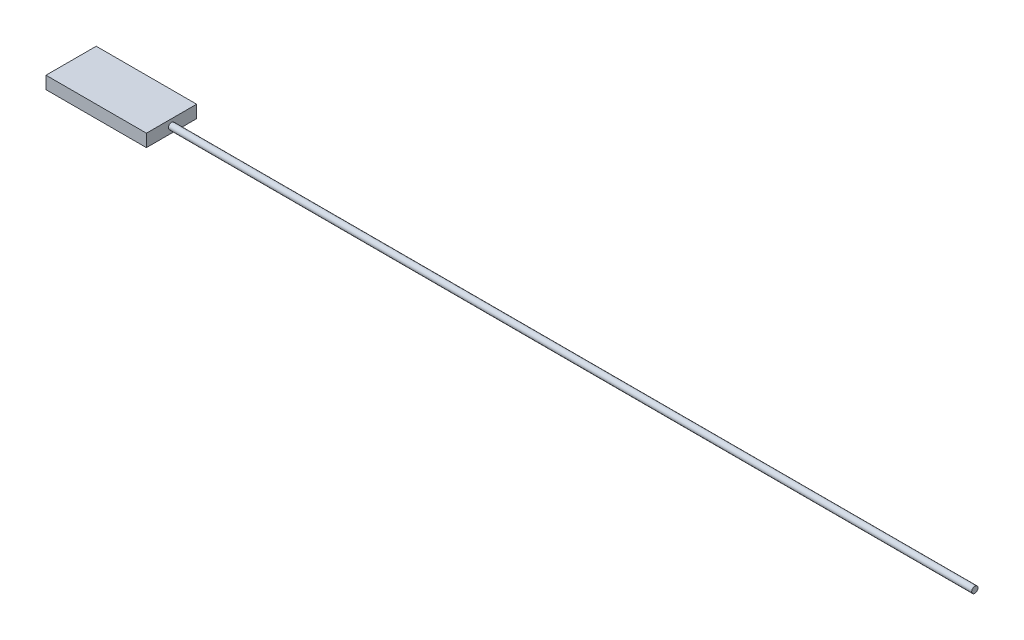
ISO-10303-21;
HEADER;
FILE_DESCRIPTION(('STEP AP214'),'2;1');
FILE_NAME('part.step','',(''),(''),'','','');
FILE_SCHEMA(('AUTOMOTIVE_DESIGN { 1 0 10303 214 1 1 1 1 }'));
ENDSEC;
DATA;
#1=APPLICATION_CONTEXT('core data for automotive mechanical design processes');
#2=APPLICATION_PROTOCOL_DEFINITION('international standard','automotive_design',2000,#1);
#3=PRODUCT_CONTEXT('',#1,'mechanical');
#4=PRODUCT('Part','Part','',(#3));
#5=PRODUCT_RELATED_PRODUCT_CATEGORY('part','',(#4));
#6=PRODUCT_DEFINITION_FORMATION('','',#4);
#7=PRODUCT_DEFINITION_CONTEXT('part definition',#1,'design');
#8=PRODUCT_DEFINITION('design','',#6,#7);
#9=PRODUCT_DEFINITION_SHAPE('','',#8);
#10=(LENGTH_UNIT() NAMED_UNIT(*) SI_UNIT(.MILLI.,.METRE.));
#11=(NAMED_UNIT(*) PLANE_ANGLE_UNIT() SI_UNIT($,.RADIAN.));
#12=(NAMED_UNIT(*) SI_UNIT($,.STERADIAN.) SOLID_ANGLE_UNIT());
#13=UNCERTAINTY_MEASURE_WITH_UNIT(LENGTH_MEASURE(1.E-05),#10,'distance_accuracy_value','');
#14=(GEOMETRIC_REPRESENTATION_CONTEXT(3) GLOBAL_UNCERTAINTY_ASSIGNED_CONTEXT((#13)) GLOBAL_UNIT_ASSIGNED_CONTEXT((#10,
#11,#12)) REPRESENTATION_CONTEXT('',''));
#15=CARTESIAN_POINT('',(0.,0.,0.));
#16=DIRECTION('',(0.,0.,1.));
#17=DIRECTION('',(1.,0.,0.));
#18=AXIS2_PLACEMENT_3D('',#15,#16,#17);
#19=CARTESIAN_POINT('',(25.4,6.35,12.7));
#20=DIRECTION('',(-1.,0.,0.));
#21=DIRECTION('',(0.,0.,1.));
#22=AXIS2_PLACEMENT_3D('',#19,#20,#21);
#23=PLANE('',#22);
#24=CARTESIAN_POINT('',(25.4,3.175,0.));
#25=DIRECTION('',(-1.,0.,0.));
#26=DIRECTION('',(0.,0.,1.));
#27=AXIS2_PLACEMENT_3D('',#24,#25,#26);
#28=CIRCLE('',#27,1.5875);
#29=CARTESIAN_POINT('',(25.4,3.175,1.5875));
#30=VERTEX_POINT('',#29);
#31=EDGE_CURVE('E11',#30,#30,#28,.F.);
#32=ORIENTED_EDGE('',*,*,#31,.F.);
#33=EDGE_LOOP('',(#32));
#34=FACE_BOUND('',#33,.T.);
#35=DIRECTION('',(0.,0.,-1.));
#36=VECTOR('',#35,1.);
#37=CARTESIAN_POINT('',(25.4,0.,12.7));
#38=LINE('',#37,#36);
#39=CARTESIAN_POINT('',(25.4,0.,12.7));
#40=VERTEX_POINT('',#39);
#41=CARTESIAN_POINT('',(25.4,0.,-12.7));
#42=VERTEX_POINT('',#41);
#43=EDGE_CURVE('E112',#40,#42,#38,.T.);
#44=ORIENTED_EDGE('',*,*,#43,.T.);
#45=DIRECTION('',(0.,-1.,0.));
#46=VECTOR('',#45,1.);
#47=CARTESIAN_POINT('',(25.4,6.35,-12.7));
#48=LINE('',#47,#46);
#49=CARTESIAN_POINT('',(25.4,6.35,-12.7));
#50=VERTEX_POINT('',#49);
#51=EDGE_CURVE('E50',#50,#42,#48,.T.);
#52=ORIENTED_EDGE('',*,*,#51,.F.);
#53=DIRECTION('',(0.,0.,-1.));
#54=VECTOR('',#53,1.);
#55=CARTESIAN_POINT('',(25.4,6.35,12.7));
#56=LINE('',#55,#54);
#57=CARTESIAN_POINT('',(25.4,6.35,12.7));
#58=VERTEX_POINT('',#57);
#59=EDGE_CURVE('E94',#58,#50,#56,.T.);
#60=ORIENTED_EDGE('',*,*,#59,.F.);
#61=DIRECTION('',(0.,-1.,0.));
#62=VECTOR('',#61,1.);
#63=CARTESIAN_POINT('',(25.4,6.35,12.7));
#64=LINE('',#63,#62);
#65=EDGE_CURVE('E108',#58,#40,#64,.T.);
#66=ORIENTED_EDGE('',*,*,#65,.T.);
#67=EDGE_LOOP('',(#44,#52,#60,#66));
#68=FACE_BOUND('',#67,.T.);
#69=ADVANCED_FACE('F41',(#34,#68),#23,.F.);
#70=CARTESIAN_POINT('',(-25.4,6.35,-12.7));
#71=DIRECTION('',(0.,0.,1.));
#72=DIRECTION('',(1.,0.,0.));
#73=AXIS2_PLACEMENT_3D('',#70,#71,#72);
#74=PLANE('',#73);
#75=DIRECTION('',(-1.,0.,0.));
#76=VECTOR('',#75,1.);
#77=CARTESIAN_POINT('',(-25.4,0.,-12.7));
#78=LINE('',#77,#76);
#79=CARTESIAN_POINT('',(-25.4,0.,-12.7));
#80=VERTEX_POINT('',#79);
#81=EDGE_CURVE('E100',#42,#80,#78,.T.);
#82=ORIENTED_EDGE('',*,*,#81,.T.);
#83=DIRECTION('',(0.,-1.,0.));
#84=VECTOR('',#83,1.);
#85=CARTESIAN_POINT('',(-25.4,6.35,-12.7));
#86=LINE('',#85,#84);
#87=CARTESIAN_POINT('',(-25.4,6.35,-12.7));
#88=VERTEX_POINT('',#87);
#89=EDGE_CURVE('E98',#88,#80,#86,.T.);
#90=ORIENTED_EDGE('',*,*,#89,.F.);
#91=DIRECTION('',(-1.,0.,0.));
#92=VECTOR('',#91,1.);
#93=CARTESIAN_POINT('',(-25.4,6.35,-12.7));
#94=LINE('',#93,#92);
#95=EDGE_CURVE('E89',#50,#88,#94,.T.);
#96=ORIENTED_EDGE('',*,*,#95,.F.);
#97=ORIENTED_EDGE('',*,*,#51,.T.);
#98=EDGE_LOOP('',(#82,#90,#96,#97));
#99=FACE_BOUND('',#98,.T.);
#100=ADVANCED_FACE('F99',(#99),#74,.F.);
#101=CARTESIAN_POINT('',(-25.4,6.35,12.7));
#102=DIRECTION('',(1.,0.,0.));
#103=DIRECTION('',(0.,0.,-1.));
#104=AXIS2_PLACEMENT_3D('',#101,#102,#103);
#105=PLANE('',#104);
#106=DIRECTION('',(0.,0.,1.));
#107=VECTOR('',#106,1.);
#108=CARTESIAN_POINT('',(-25.4,0.,12.7));
#109=LINE('',#108,#107);
#110=CARTESIAN_POINT('',(-25.4,0.,12.7));
#111=VERTEX_POINT('',#110);
#112=EDGE_CURVE('E75',#80,#111,#109,.T.);
#113=ORIENTED_EDGE('',*,*,#112,.T.);
#114=DIRECTION('',(0.,-1.,0.));
#115=VECTOR('',#114,1.);
#116=CARTESIAN_POINT('',(-25.4,6.35,12.7));
#117=LINE('',#116,#115);
#118=CARTESIAN_POINT('',(-25.4,6.35,12.7));
#119=VERTEX_POINT('',#118);
#120=EDGE_CURVE('E102',#119,#111,#117,.T.);
#121=ORIENTED_EDGE('',*,*,#120,.F.);
#122=DIRECTION('',(0.,0.,1.));
#123=VECTOR('',#122,1.);
#124=CARTESIAN_POINT('',(-25.4,6.35,12.7));
#125=LINE('',#124,#123);
#126=EDGE_CURVE('E92',#88,#119,#125,.T.);
#127=ORIENTED_EDGE('',*,*,#126,.F.);
#128=ORIENTED_EDGE('',*,*,#89,.T.);
#129=EDGE_LOOP('',(#113,#121,#127,#128));
#130=FACE_BOUND('',#129,.T.);
#131=ADVANCED_FACE('F104',(#130),#105,.F.);
#132=CARTESIAN_POINT('',(-25.4,6.35,12.7));
#133=DIRECTION('',(0.,0.,-1.));
#134=DIRECTION('',(-1.,0.,0.));
#135=AXIS2_PLACEMENT_3D('',#132,#133,#134);
#136=PLANE('',#135);
#137=DIRECTION('',(1.,0.,0.));
#138=VECTOR('',#137,1.);
#139=CARTESIAN_POINT('',(-25.4,0.,12.7));
#140=LINE('',#139,#138);
#141=EDGE_CURVE('E81',#111,#40,#140,.T.);
#142=ORIENTED_EDGE('',*,*,#141,.T.);
#143=ORIENTED_EDGE('',*,*,#65,.F.);
#144=DIRECTION('',(1.,0.,0.));
#145=VECTOR('',#144,1.);
#146=CARTESIAN_POINT('',(-25.4,6.35,12.7));
#147=LINE('',#146,#145);
#148=EDGE_CURVE('E58',#119,#58,#147,.T.);
#149=ORIENTED_EDGE('',*,*,#148,.F.);
#150=ORIENTED_EDGE('',*,*,#120,.T.);
#151=EDGE_LOOP('',(#142,#143,#149,#150));
#152=FACE_BOUND('',#151,.T.);
#153=ADVANCED_FACE('F141',(#152),#136,.F.);
#154=CARTESIAN_POINT('',(0.,6.35,0.));
#155=DIRECTION('',(0.,-1.,0.));
#156=DIRECTION('',(0.,0.,-1.));
#157=AXIS2_PLACEMENT_3D('',#154,#155,#156);
#158=PLANE('',#157);
#159=ORIENTED_EDGE('',*,*,#59,.T.);
#160=ORIENTED_EDGE('',*,*,#95,.T.);
#161=ORIENTED_EDGE('',*,*,#126,.T.);
#162=ORIENTED_EDGE('',*,*,#148,.T.);
#163=EDGE_LOOP('',(#159,#160,#161,#162));
#164=FACE_BOUND('',#163,.T.);
#165=ADVANCED_FACE('F90',(#164),#158,.F.);
#166=CARTESIAN_POINT('',(0.,0.,0.));
#167=DIRECTION('',(0.,-1.,0.));
#168=DIRECTION('',(0.,0.,-1.));
#169=AXIS2_PLACEMENT_3D('',#166,#167,#168);
#170=PLANE('',#169);
#171=ORIENTED_EDGE('',*,*,#43,.F.);
#172=ORIENTED_EDGE('',*,*,#141,.F.);
#173=ORIENTED_EDGE('',*,*,#112,.F.);
#174=ORIENTED_EDGE('',*,*,#81,.F.);
#175=EDGE_LOOP('',(#171,#172,#173,#174));
#176=FACE_BOUND('',#175,.T.);
#177=ADVANCED_FACE('F130',(#176),#170,.T.);
#178=CARTESIAN_POINT('',(431.8,3.175,0.));
#179=DIRECTION('',(-1.,0.,0.));
#180=DIRECTION('',(0.,0.,1.));
#181=AXIS2_PLACEMENT_3D('',#178,#179,#180);
#182=CYLINDRICAL_SURFACE('',#181,1.5875);
#183=CARTESIAN_POINT('',(431.8,3.175,0.));
#184=DIRECTION('',(1.,0.,0.));
#185=DIRECTION('',(0.,0.,-1.));
#186=AXIS2_PLACEMENT_3D('',#183,#184,#185);
#187=CIRCLE('',#186,1.5875);
#188=CARTESIAN_POINT('',(431.8,3.175,-1.5875));
#189=VERTEX_POINT('',#188);
#190=EDGE_CURVE('E116',#189,#189,#187,.T.);
#191=ORIENTED_EDGE('',*,*,#190,.F.);
#192=EDGE_LOOP('',(#191));
#193=FACE_BOUND('',#192,.T.);
#194=ORIENTED_EDGE('',*,*,#31,.T.);
#195=EDGE_LOOP('',(#194));
#196=FACE_BOUND('',#195,.T.);
#197=ADVANCED_FACE('F132',(#193,#196),#182,.T.);
#198=CARTESIAN_POINT('',(431.8,3.175,0.));
#199=DIRECTION('',(1.,0.,0.));
#200=DIRECTION('',(0.,0.,-1.));
#201=AXIS2_PLACEMENT_3D('',#198,#199,#200);
#202=PLANE('',#201);
#203=ORIENTED_EDGE('',*,*,#190,.T.);
#204=EDGE_LOOP('',(#203));
#205=FACE_BOUND('',#204,.T.);
#206=ADVANCED_FACE('F138',(#205),#202,.T.);
#207=CLOSED_SHELL('',(#69,#100,#131,#153,#165,#177,#197,#206));
#208=MANIFOLD_SOLID_BREP('B2',#207);
#209=ADVANCED_BREP_SHAPE_REPRESENTATION('',(#18,#208),#14);
#210=SHAPE_DEFINITION_REPRESENTATION(#9,#209);
ENDSEC;
END-ISO-10303-21;
